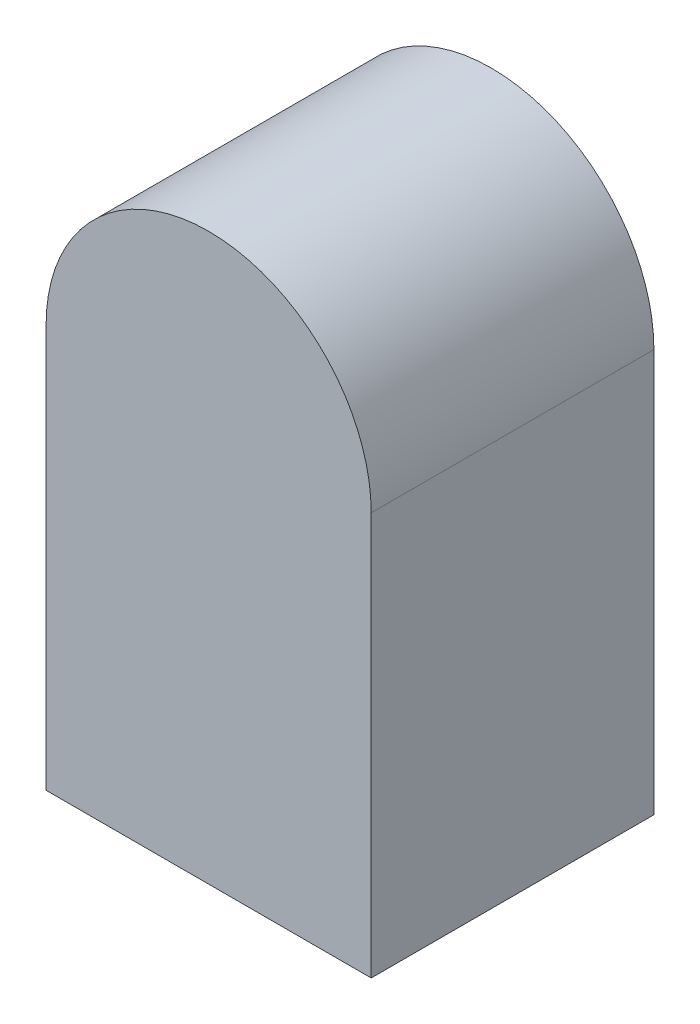
ISO-10303-21;
HEADER;
FILE_DESCRIPTION(('STEP AP214'),'2;1');
FILE_NAME('part.step','',(''),(''),'','','');
FILE_SCHEMA(('AUTOMOTIVE_DESIGN { 1 0 10303 214 1 1 1 1 }'));
ENDSEC;
DATA;
#1=APPLICATION_CONTEXT('core data for automotive mechanical design processes');
#2=APPLICATION_PROTOCOL_DEFINITION('international standard','automotive_design',2000,#1);
#3=PRODUCT_CONTEXT('',#1,'mechanical');
#4=PRODUCT('Part','Part','',(#3));
#5=PRODUCT_RELATED_PRODUCT_CATEGORY('part','',(#4));
#6=PRODUCT_DEFINITION_FORMATION('','',#4);
#7=PRODUCT_DEFINITION_CONTEXT('part definition',#1,'design');
#8=PRODUCT_DEFINITION('design','',#6,#7);
#9=PRODUCT_DEFINITION_SHAPE('','',#8);
#10=(LENGTH_UNIT() NAMED_UNIT(*) SI_UNIT(.MILLI.,.METRE.));
#11=(NAMED_UNIT(*) PLANE_ANGLE_UNIT() SI_UNIT($,.RADIAN.));
#12=(NAMED_UNIT(*) SI_UNIT($,.STERADIAN.) SOLID_ANGLE_UNIT());
#13=UNCERTAINTY_MEASURE_WITH_UNIT(LENGTH_MEASURE(1.E-05),#10,'distance_accuracy_value','');
#14=(GEOMETRIC_REPRESENTATION_CONTEXT(3) GLOBAL_UNCERTAINTY_ASSIGNED_CONTEXT((#13)) GLOBAL_UNIT_ASSIGNED_CONTEXT((#10,
#11,#12)) REPRESENTATION_CONTEXT('',''));
#15=CARTESIAN_POINT('',(0.,0.,0.));
#16=DIRECTION('',(0.,0.,1.));
#17=DIRECTION('',(1.,0.,0.));
#18=AXIS2_PLACEMENT_3D('',#15,#16,#17);
#19=CARTESIAN_POINT('',(0.75,-2.8335240809167,0.2));
#20=DIRECTION('',(0.,0.,1.));
#21=DIRECTION('',(1.,0.,0.));
#22=AXIS2_PLACEMENT_3D('',#19,#20,#21);
#23=PLANE('',#22);
#24=DIRECTION('',(0.,-1.,0.));
#25=VECTOR('',#24,1.);
#26=CARTESIAN_POINT('',(0.635,-2.715,0.2));
#27=LINE('',#26,#25);
#28=CARTESIAN_POINT('',(0.635,-2.715,0.2));
#29=VERTEX_POINT('',#28);
#30=CARTESIAN_POINT('',(0.635,-3.,0.2));
#31=VERTEX_POINT('',#30);
#32=EDGE_CURVE('E11',#29,#31,#27,.T.);
#33=ORIENTED_EDGE('',*,*,#32,.T.);
#34=DIRECTION('',(1.,0.,0.));
#35=VECTOR('',#34,1.);
#36=CARTESIAN_POINT('',(-1.125,-3.,0.2));
#37=LINE('',#36,#35);
#38=CARTESIAN_POINT('',(0.865,-3.,0.2));
#39=VERTEX_POINT('',#38);
#40=EDGE_CURVE('E24',#31,#39,#37,.T.);
#41=ORIENTED_EDGE('',*,*,#40,.T.);
#42=DIRECTION('',(0.,1.,0.));
#43=VECTOR('',#42,1.);
#44=CARTESIAN_POINT('',(0.865,-3.,0.2));
#45=LINE('',#44,#43);
#46=CARTESIAN_POINT('',(0.865,-2.715,0.2));
#47=VERTEX_POINT('',#46);
#48=EDGE_CURVE('E88',#39,#47,#45,.T.);
#49=ORIENTED_EDGE('',*,*,#48,.T.);
#50=CARTESIAN_POINT('',(0.75,-2.715,0.2));
#51=DIRECTION('',(0.,0.,1.));
#52=DIRECTION('',(1.,0.,0.));
#53=AXIS2_PLACEMENT_3D('',#50,#51,#52);
#54=CIRCLE('',#53,0.115);
#55=EDGE_CURVE('E70',#47,#29,#54,.T.);
#56=ORIENTED_EDGE('',*,*,#55,.T.);
#57=EDGE_LOOP('',(#33,#41,#49,#56));
#58=FACE_BOUND('',#57,.T.);
#59=ADVANCED_FACE('F17',(#58),#23,.T.);
#60=CARTESIAN_POINT('',(-3.,-3.,0.));
#61=DIRECTION('',(0.,-1.,0.));
#62=DIRECTION('',(1.,0.,0.));
#63=AXIS2_PLACEMENT_3D('',#60,#61,#62);
#64=PLANE('',#63);
#65=DIRECTION('',(0.,0.,-1.));
#66=VECTOR('',#65,1.);
#67=CARTESIAN_POINT('',(0.865,-3.,0.));
#68=LINE('',#67,#66);
#69=CARTESIAN_POINT('',(0.865,-3.,0.));
#70=VERTEX_POINT('',#69);
#71=EDGE_CURVE('E76',#39,#70,#68,.T.);
#72=ORIENTED_EDGE('',*,*,#71,.F.);
#73=ORIENTED_EDGE('',*,*,#40,.F.);
#74=DIRECTION('',(0.,0.,1.));
#75=VECTOR('',#74,1.);
#76=CARTESIAN_POINT('',(0.635,-3.,0.));
#77=LINE('',#76,#75);
#78=CARTESIAN_POINT('',(0.635,-3.,0.));
#79=VERTEX_POINT('',#78);
#80=EDGE_CURVE('E84',#79,#31,#77,.T.);
#81=ORIENTED_EDGE('',*,*,#80,.F.);
#82=DIRECTION('',(1.,0.,0.));
#83=VECTOR('',#82,1.);
#84=CARTESIAN_POINT('',(0.635,-3.,0.));
#85=LINE('',#84,#83);
#86=EDGE_CURVE('E82',#79,#70,#85,.T.);
#87=ORIENTED_EDGE('',*,*,#86,.T.);
#88=EDGE_LOOP('',(#72,#73,#81,#87));
#89=FACE_BOUND('',#88,.T.);
#90=ADVANCED_FACE('F90',(#89),#64,.T.);
#91=CARTESIAN_POINT('',(0.635,-2.715,0.));
#92=DIRECTION('',(-1.,0.,0.));
#93=DIRECTION('',(0.,-1.,0.));
#94=AXIS2_PLACEMENT_3D('',#91,#92,#93);
#95=PLANE('',#94);
#96=DIRECTION('',(0.,-1.,0.));
#97=VECTOR('',#96,1.);
#98=CARTESIAN_POINT('',(0.635,-2.715,0.));
#99=LINE('',#98,#97);
#100=CARTESIAN_POINT('',(0.635,-2.715,0.));
#101=VERTEX_POINT('',#100);
#102=EDGE_CURVE('E61',#101,#79,#99,.T.);
#103=ORIENTED_EDGE('',*,*,#102,.T.);
#104=ORIENTED_EDGE('',*,*,#80,.T.);
#105=ORIENTED_EDGE('',*,*,#32,.F.);
#106=DIRECTION('',(0.,0.,1.));
#107=VECTOR('',#106,1.);
#108=CARTESIAN_POINT('',(0.635,-2.715,0.));
#109=LINE('',#108,#107);
#110=EDGE_CURVE('E64',#101,#29,#109,.T.);
#111=ORIENTED_EDGE('',*,*,#110,.F.);
#112=EDGE_LOOP('',(#103,#104,#105,#111));
#113=FACE_BOUND('',#112,.T.);
#114=ADVANCED_FACE('F91',(#113),#95,.T.);
#115=CARTESIAN_POINT('',(0.75,-2.715,0.));
#116=DIRECTION('',(0.,0.,1.));
#117=DIRECTION('',(1.,0.,0.));
#118=AXIS2_PLACEMENT_3D('',#115,#116,#117);
#119=CYLINDRICAL_SURFACE('',#118,0.115);
#120=CARTESIAN_POINT('',(0.75,-2.715,0.));
#121=DIRECTION('',(0.,0.,1.));
#122=DIRECTION('',(1.,0.,0.));
#123=AXIS2_PLACEMENT_3D('',#120,#121,#122);
#124=CIRCLE('',#123,0.115);
#125=CARTESIAN_POINT('',(0.865,-2.715,0.));
#126=VERTEX_POINT('',#125);
#127=EDGE_CURVE('E54',#126,#101,#124,.T.);
#128=ORIENTED_EDGE('',*,*,#127,.T.);
#129=ORIENTED_EDGE('',*,*,#110,.T.);
#130=ORIENTED_EDGE('',*,*,#55,.F.);
#131=DIRECTION('',(0.,0.,1.));
#132=VECTOR('',#131,1.);
#133=CARTESIAN_POINT('',(0.865,-2.715,0.));
#134=LINE('',#133,#132);
#135=EDGE_CURVE('E65',#126,#47,#134,.T.);
#136=ORIENTED_EDGE('',*,*,#135,.F.);
#137=EDGE_LOOP('',(#128,#129,#130,#136));
#138=FACE_BOUND('',#137,.T.);
#139=ADVANCED_FACE('F69',(#138),#119,.T.);
#140=CARTESIAN_POINT('',(0.865,-3.,0.));
#141=DIRECTION('',(1.,0.,0.));
#142=DIRECTION('',(0.,1.,0.));
#143=AXIS2_PLACEMENT_3D('',#140,#141,#142);
#144=PLANE('',#143);
#145=DIRECTION('',(0.,1.,0.));
#146=VECTOR('',#145,1.);
#147=CARTESIAN_POINT('',(0.865,-3.,0.));
#148=LINE('',#147,#146);
#149=EDGE_CURVE('E59',#70,#126,#148,.T.);
#150=ORIENTED_EDGE('',*,*,#149,.T.);
#151=ORIENTED_EDGE('',*,*,#135,.T.);
#152=ORIENTED_EDGE('',*,*,#48,.F.);
#153=ORIENTED_EDGE('',*,*,#71,.T.);
#154=EDGE_LOOP('',(#150,#151,#152,#153));
#155=FACE_BOUND('',#154,.T.);
#156=ADVANCED_FACE('F74',(#155),#144,.T.);
#157=CARTESIAN_POINT('',(0.75,-2.8335265642716,0.));
#158=DIRECTION('',(0.,0.,1.));
#159=DIRECTION('',(0.,1.,0.));
#160=AXIS2_PLACEMENT_3D('',#157,#158,#159);
#161=PLANE('',#160);
#162=ORIENTED_EDGE('',*,*,#86,.F.);
#163=ORIENTED_EDGE('',*,*,#102,.F.);
#164=ORIENTED_EDGE('',*,*,#127,.F.);
#165=ORIENTED_EDGE('',*,*,#149,.F.);
#166=EDGE_LOOP('',(#162,#163,#164,#165));
#167=FACE_BOUND('',#166,.T.);
#168=ADVANCED_FACE('F57',(#167),#161,.F.);
#169=CLOSED_SHELL('',(#59,#90,#114,#139,#156,#168));
#170=MANIFOLD_SOLID_BREP('B1',#169);
#171=ADVANCED_BREP_SHAPE_REPRESENTATION('',(#18,#170),#14);
#172=SHAPE_DEFINITION_REPRESENTATION(#9,#171);
ENDSEC;
END-ISO-10303-21;
